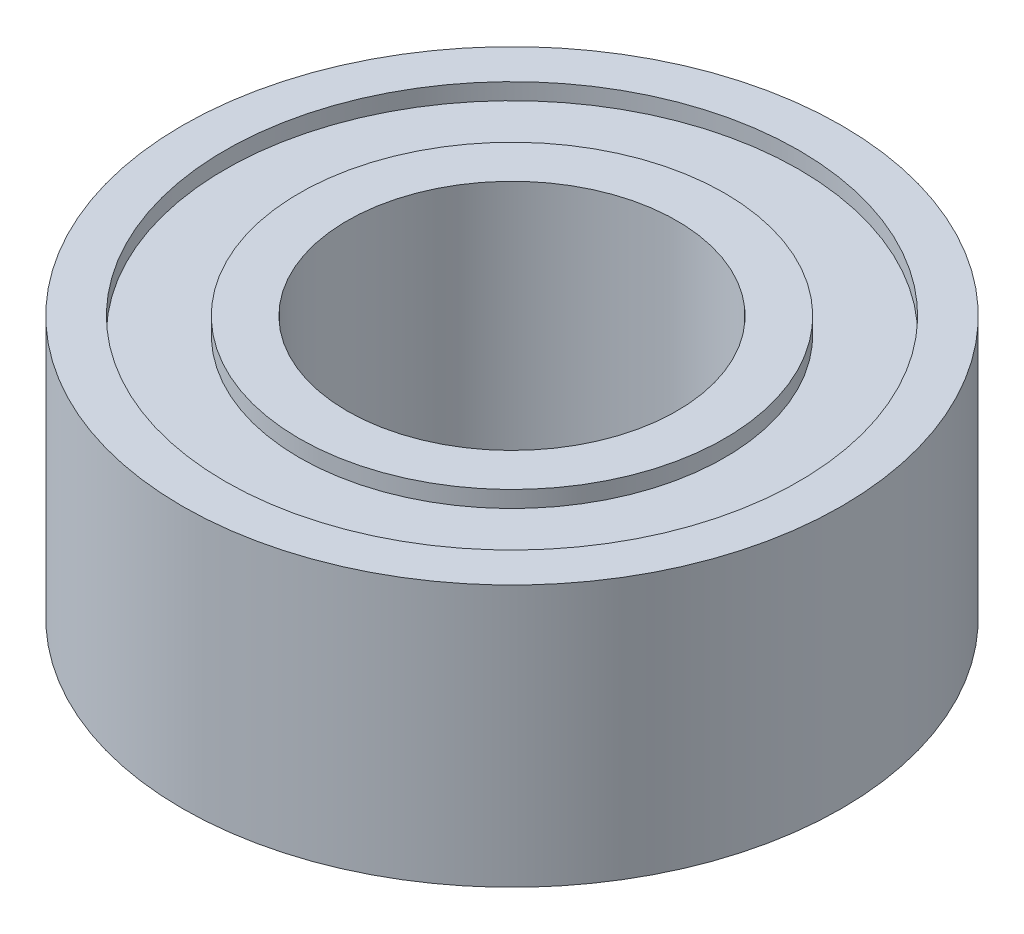
ISO-10303-21;
HEADER;
FILE_DESCRIPTION(('STEP AP214'),'2;1');
FILE_NAME('part.step','',(''),(''),'','','');
FILE_SCHEMA(('AUTOMOTIVE_DESIGN { 1 0 10303 214 1 1 1 1 }'));
ENDSEC;
DATA;
#1=APPLICATION_CONTEXT('core data for automotive mechanical design processes');
#2=APPLICATION_PROTOCOL_DEFINITION('international standard','automotive_design',2000,#1);
#3=PRODUCT_CONTEXT('',#1,'mechanical');
#4=PRODUCT('Part','Part','',(#3));
#5=PRODUCT_RELATED_PRODUCT_CATEGORY('part','',(#4));
#6=PRODUCT_DEFINITION_FORMATION('','',#4);
#7=PRODUCT_DEFINITION_CONTEXT('part definition',#1,'design');
#8=PRODUCT_DEFINITION('design','',#6,#7);
#9=PRODUCT_DEFINITION_SHAPE('','',#8);
#10=(LENGTH_UNIT() NAMED_UNIT(*) SI_UNIT(.MILLI.,.METRE.));
#11=(NAMED_UNIT(*) PLANE_ANGLE_UNIT() SI_UNIT($,.RADIAN.));
#12=(NAMED_UNIT(*) SI_UNIT($,.STERADIAN.) SOLID_ANGLE_UNIT());
#13=UNCERTAINTY_MEASURE_WITH_UNIT(LENGTH_MEASURE(1.E-05),#10,'distance_accuracy_value','');
#14=(GEOMETRIC_REPRESENTATION_CONTEXT(3) GLOBAL_UNCERTAINTY_ASSIGNED_CONTEXT((#13)) GLOBAL_UNIT_ASSIGNED_CONTEXT((#10,
#11,#12)) REPRESENTATION_CONTEXT('',''));
#15=CARTESIAN_POINT('',(0.,0.,0.));
#16=DIRECTION('',(0.,0.,1.));
#17=DIRECTION('',(1.,0.,0.));
#18=AXIS2_PLACEMENT_3D('',#15,#16,#17);
#19=CARTESIAN_POINT('',(0.,0.,0.));
#20=DIRECTION('',(0.,1.,0.));
#21=DIRECTION('',(0.,0.,1.));
#22=AXIS2_PLACEMENT_3D('',#19,#20,#21);
#23=PLANE('',#22);
#24=CARTESIAN_POINT('',(0.,0.,0.));
#25=DIRECTION('',(0.,1.,0.));
#26=DIRECTION('',(0.,0.,1.));
#27=AXIS2_PLACEMENT_3D('',#24,#25,#26);
#28=CIRCLE('',#27,2.5);
#29=CARTESIAN_POINT('',(0.,0.,2.5));
#30=VERTEX_POINT('',#29);
#31=EDGE_CURVE('E57',#30,#30,#28,.T.);
#32=ORIENTED_EDGE('',*,*,#31,.T.);
#33=EDGE_LOOP('',(#32));
#34=FACE_BOUND('',#33,.T.);
#35=CARTESIAN_POINT('',(0.,0.,0.));
#36=DIRECTION('',(0.,-1.,0.));
#37=DIRECTION('',(0.,0.,-1.));
#38=AXIS2_PLACEMENT_3D('',#35,#36,#37);
#39=CIRCLE('',#38,3.225);
#40=CARTESIAN_POINT('',(0.,0.,-3.225));
#41=VERTEX_POINT('',#40);
#42=EDGE_CURVE('E81',#41,#41,#39,.T.);
#43=ORIENTED_EDGE('',*,*,#42,.T.);
#44=EDGE_LOOP('',(#43));
#45=FACE_BOUND('',#44,.T.);
#46=ADVANCED_FACE('F44',(#34,#45),#23,.F.);
#47=CARTESIAN_POINT('',(0.,3.97,0.));
#48=DIRECTION('',(0.,1.,0.));
#49=DIRECTION('',(0.,0.,1.));
#50=AXIS2_PLACEMENT_3D('',#47,#48,#49);
#51=PLANE('',#50);
#52=CARTESIAN_POINT('',(0.,3.97,0.));
#53=DIRECTION('',(0.,1.,0.));
#54=DIRECTION('',(0.,0.,1.));
#55=AXIS2_PLACEMENT_3D('',#52,#53,#54);
#56=CIRCLE('',#55,2.5);
#57=CARTESIAN_POINT('',(0.,3.97,2.5));
#58=VERTEX_POINT('',#57);
#59=EDGE_CURVE('E55',#58,#58,#56,.T.);
#60=ORIENTED_EDGE('',*,*,#59,.F.);
#61=EDGE_LOOP('',(#60));
#62=FACE_BOUND('',#61,.T.);
#63=CARTESIAN_POINT('',(0.,3.97,0.));
#64=DIRECTION('',(0.,1.,0.));
#65=DIRECTION('',(0.,0.,1.));
#66=AXIS2_PLACEMENT_3D('',#63,#64,#65);
#67=CIRCLE('',#66,3.225);
#68=CARTESIAN_POINT('',(0.,3.97,3.225));
#69=VERTEX_POINT('',#68);
#70=EDGE_CURVE('E69',#69,#69,#67,.T.);
#71=ORIENTED_EDGE('',*,*,#70,.T.);
#72=EDGE_LOOP('',(#71));
#73=FACE_BOUND('',#72,.T.);
#74=ADVANCED_FACE('F119',(#62,#73),#51,.T.);
#75=CARTESIAN_POINT('',(0.,3.97,0.));
#76=DIRECTION('',(0.,1.,0.));
#77=DIRECTION('',(0.,0.,1.));
#78=AXIS2_PLACEMENT_3D('',#75,#76,#77);
#79=CIRCLE('',#78,4.35);
#80=CARTESIAN_POINT('',(0.,3.97,4.35));
#81=VERTEX_POINT('',#80);
#82=EDGE_CURVE('E63',#81,#81,#79,.T.);
#83=ORIENTED_EDGE('',*,*,#82,.F.);
#84=EDGE_LOOP('',(#83));
#85=FACE_BOUND('',#84,.T.);
#86=CARTESIAN_POINT('',(0.,3.97,0.));
#87=DIRECTION('',(0.,1.,0.));
#88=DIRECTION('',(0.,0.,1.));
#89=AXIS2_PLACEMENT_3D('',#86,#87,#88);
#90=CIRCLE('',#89,5.);
#91=CARTESIAN_POINT('',(0.,3.97,5.));
#92=VERTEX_POINT('',#91);
#93=EDGE_CURVE('E12',#92,#92,#90,.T.);
#94=ORIENTED_EDGE('',*,*,#93,.T.);
#95=EDGE_LOOP('',(#94));
#96=FACE_BOUND('',#95,.T.);
#97=ADVANCED_FACE('F106',(#85,#96),#51,.T.);
#98=CARTESIAN_POINT('',(0.,0.,0.));
#99=DIRECTION('',(0.,-1.,0.));
#100=DIRECTION('',(0.,0.,-1.));
#101=AXIS2_PLACEMENT_3D('',#98,#99,#100);
#102=CIRCLE('',#101,4.35);
#103=CARTESIAN_POINT('',(0.,0.,-4.35));
#104=VERTEX_POINT('',#103);
#105=EDGE_CURVE('E75',#104,#104,#102,.T.);
#106=ORIENTED_EDGE('',*,*,#105,.F.);
#107=EDGE_LOOP('',(#106));
#108=FACE_BOUND('',#107,.T.);
#109=CARTESIAN_POINT('',(0.,0.,0.));
#110=DIRECTION('',(0.,1.,0.));
#111=DIRECTION('',(0.,0.,1.));
#112=AXIS2_PLACEMENT_3D('',#109,#110,#111);
#113=CIRCLE('',#112,5.);
#114=CARTESIAN_POINT('',(0.,0.,5.));
#115=VERTEX_POINT('',#114);
#116=EDGE_CURVE('E48',#115,#115,#113,.T.);
#117=ORIENTED_EDGE('',*,*,#116,.F.);
#118=EDGE_LOOP('',(#117));
#119=FACE_BOUND('',#118,.T.);
#120=ADVANCED_FACE('F103',(#108,#119),#23,.F.);
#121=CARTESIAN_POINT('',(0.,3.97,0.));
#122=DIRECTION('',(0.,-1.,0.));
#123=DIRECTION('',(0.,0.,-1.));
#124=AXIS2_PLACEMENT_3D('',#121,#122,#123);
#125=CYLINDRICAL_SURFACE('',#124,5.);
#126=ORIENTED_EDGE('',*,*,#93,.F.);
#127=EDGE_LOOP('',(#126));
#128=FACE_BOUND('',#127,.T.);
#129=ORIENTED_EDGE('',*,*,#116,.T.);
#130=EDGE_LOOP('',(#129));
#131=FACE_BOUND('',#130,.T.);
#132=ADVANCED_FACE('F46',(#128,#131),#125,.T.);
#133=CARTESIAN_POINT('',(0.,3.97,0.));
#134=DIRECTION('',(0.,-1.,0.));
#135=DIRECTION('',(0.,0.,-1.));
#136=AXIS2_PLACEMENT_3D('',#133,#134,#135);
#137=CYLINDRICAL_SURFACE('',#136,2.5);
#138=ORIENTED_EDGE('',*,*,#59,.T.);
#139=EDGE_LOOP('',(#138));
#140=FACE_BOUND('',#139,.T.);
#141=ORIENTED_EDGE('',*,*,#31,.F.);
#142=EDGE_LOOP('',(#141));
#143=FACE_BOUND('',#142,.T.);
#144=ADVANCED_FACE('F110',(#140,#143),#137,.F.);
#145=CARTESIAN_POINT('',(0.,3.72,0.));
#146=DIRECTION('',(0.,1.,0.));
#147=DIRECTION('',(0.,0.,1.));
#148=AXIS2_PLACEMENT_3D('',#145,#146,#147);
#149=CYLINDRICAL_SURFACE('',#148,4.35);
#150=CARTESIAN_POINT('',(0.,3.72,0.));
#151=DIRECTION('',(0.,1.,0.));
#152=DIRECTION('',(0.,0.,1.));
#153=AXIS2_PLACEMENT_3D('',#150,#151,#152);
#154=CIRCLE('',#153,4.35);
#155=CARTESIAN_POINT('',(0.,3.72,4.35));
#156=VERTEX_POINT('',#155);
#157=EDGE_CURVE('E60',#156,#156,#154,.T.);
#158=ORIENTED_EDGE('',*,*,#157,.F.);
#159=EDGE_LOOP('',(#158));
#160=FACE_BOUND('',#159,.T.);
#161=ORIENTED_EDGE('',*,*,#82,.T.);
#162=EDGE_LOOP('',(#161));
#163=FACE_BOUND('',#162,.T.);
#164=ADVANCED_FACE('F115',(#160,#163),#149,.F.);
#165=CARTESIAN_POINT('',(0.,3.72,0.));
#166=DIRECTION('',(0.,1.,0.));
#167=DIRECTION('',(0.,0.,1.));
#168=AXIS2_PLACEMENT_3D('',#165,#166,#167);
#169=PLANE('',#168);
#170=CARTESIAN_POINT('',(0.,3.72,0.));
#171=DIRECTION('',(0.,1.,0.));
#172=DIRECTION('',(0.,0.,1.));
#173=AXIS2_PLACEMENT_3D('',#170,#171,#172);
#174=CIRCLE('',#173,3.225);
#175=CARTESIAN_POINT('',(0.,3.72,3.225));
#176=VERTEX_POINT('',#175);
#177=EDGE_CURVE('E66',#176,#176,#174,.T.);
#178=ORIENTED_EDGE('',*,*,#177,.F.);
#179=EDGE_LOOP('',(#178));
#180=FACE_BOUND('',#179,.T.);
#181=ORIENTED_EDGE('',*,*,#157,.T.);
#182=EDGE_LOOP('',(#181));
#183=FACE_BOUND('',#182,.T.);
#184=ADVANCED_FACE('F132',(#180,#183),#169,.T.);
#185=CARTESIAN_POINT('',(0.,3.72,0.));
#186=DIRECTION('',(0.,1.,0.));
#187=DIRECTION('',(0.,0.,1.));
#188=AXIS2_PLACEMENT_3D('',#185,#186,#187);
#189=CYLINDRICAL_SURFACE('',#188,3.225);
#190=ORIENTED_EDGE('',*,*,#177,.T.);
#191=EDGE_LOOP('',(#190));
#192=FACE_BOUND('',#191,.T.);
#193=ORIENTED_EDGE('',*,*,#70,.F.);
#194=EDGE_LOOP('',(#193));
#195=FACE_BOUND('',#194,.T.);
#196=ADVANCED_FACE('F99',(#192,#195),#189,.T.);
#197=CARTESIAN_POINT('',(0.,0.25,0.));
#198=DIRECTION('',(0.,-1.,0.));
#199=DIRECTION('',(0.,0.,-1.));
#200=AXIS2_PLACEMENT_3D('',#197,#198,#199);
#201=CYLINDRICAL_SURFACE('',#200,4.35);
#202=CARTESIAN_POINT('',(0.,0.25,0.));
#203=DIRECTION('',(0.,-1.,0.));
#204=DIRECTION('',(0.,0.,-1.));
#205=AXIS2_PLACEMENT_3D('',#202,#203,#204);
#206=CIRCLE('',#205,4.35);
#207=CARTESIAN_POINT('',(0.,0.25,-4.35));
#208=VERTEX_POINT('',#207);
#209=EDGE_CURVE('E72',#208,#208,#206,.T.);
#210=ORIENTED_EDGE('',*,*,#209,.F.);
#211=EDGE_LOOP('',(#210));
#212=FACE_BOUND('',#211,.T.);
#213=ORIENTED_EDGE('',*,*,#105,.T.);
#214=EDGE_LOOP('',(#213));
#215=FACE_BOUND('',#214,.T.);
#216=ADVANCED_FACE('F93',(#212,#215),#201,.F.);
#217=CARTESIAN_POINT('',(0.,0.25,0.));
#218=DIRECTION('',(0.,-1.,0.));
#219=DIRECTION('',(0.,0.,-1.));
#220=AXIS2_PLACEMENT_3D('',#217,#218,#219);
#221=PLANE('',#220);
#222=CARTESIAN_POINT('',(0.,0.25,0.));
#223=DIRECTION('',(0.,-1.,0.));
#224=DIRECTION('',(0.,0.,-1.));
#225=AXIS2_PLACEMENT_3D('',#222,#223,#224);
#226=CIRCLE('',#225,3.225);
#227=CARTESIAN_POINT('',(0.,0.25,-3.225));
#228=VERTEX_POINT('',#227);
#229=EDGE_CURVE('E78',#228,#228,#226,.T.);
#230=ORIENTED_EDGE('',*,*,#229,.F.);
#231=EDGE_LOOP('',(#230));
#232=FACE_BOUND('',#231,.T.);
#233=ORIENTED_EDGE('',*,*,#209,.T.);
#234=EDGE_LOOP('',(#233));
#235=FACE_BOUND('',#234,.T.);
#236=ADVANCED_FACE('F90',(#232,#235),#221,.T.);
#237=CARTESIAN_POINT('',(0.,0.25,0.));
#238=DIRECTION('',(0.,-1.,0.));
#239=DIRECTION('',(0.,0.,-1.));
#240=AXIS2_PLACEMENT_3D('',#237,#238,#239);
#241=CYLINDRICAL_SURFACE('',#240,3.225);
#242=ORIENTED_EDGE('',*,*,#229,.T.);
#243=EDGE_LOOP('',(#242));
#244=FACE_BOUND('',#243,.T.);
#245=ORIENTED_EDGE('',*,*,#42,.F.);
#246=EDGE_LOOP('',(#245));
#247=FACE_BOUND('',#246,.T.);
#248=ADVANCED_FACE('F87',(#244,#247),#241,.T.);
#249=CLOSED_SHELL('',(#46,#74,#97,#120,#132,#144,#164,#184,#196,#216,#236,#248));
#250=MANIFOLD_SOLID_BREP('B2',#249);
#251=ADVANCED_BREP_SHAPE_REPRESENTATION('',(#18,#250),#14);
#252=SHAPE_DEFINITION_REPRESENTATION(#9,#251);
ENDSEC;
END-ISO-10303-21;
